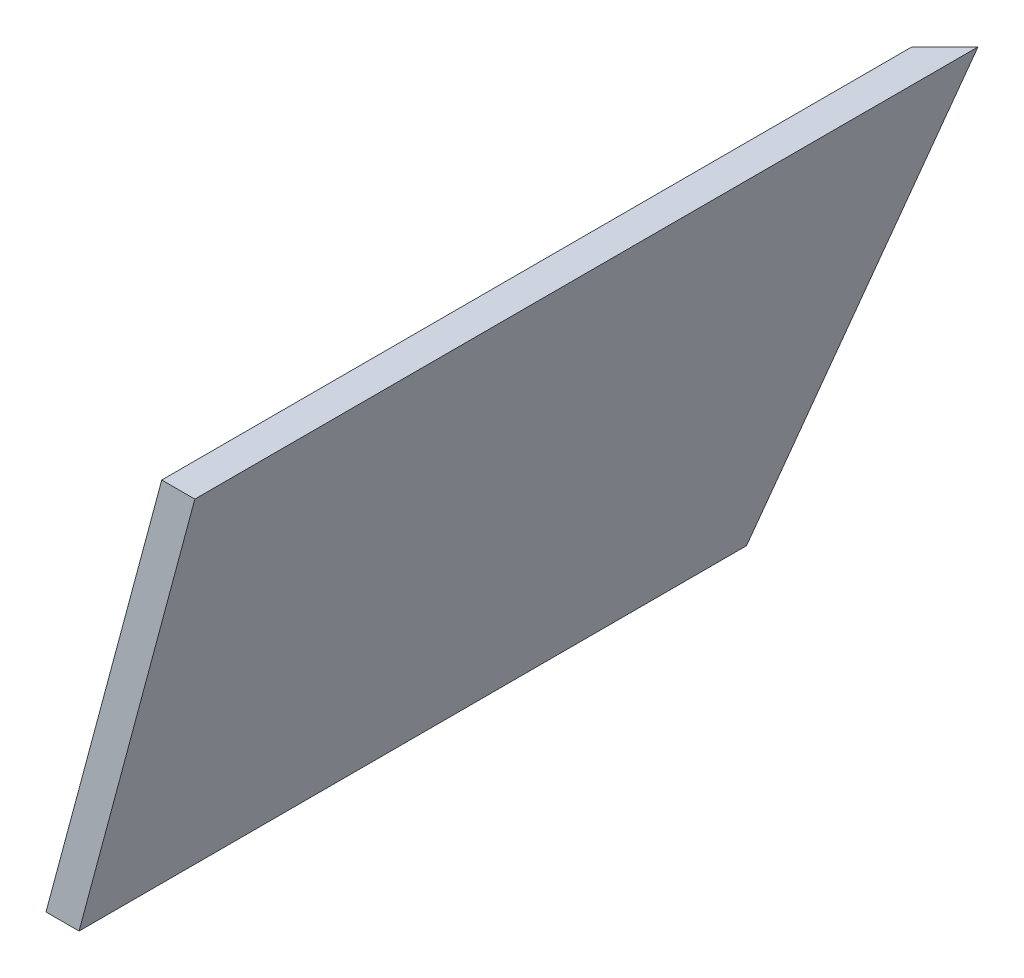
ISO-10303-21;
HEADER;
FILE_DESCRIPTION(('STEP AP214'),'2;1');
FILE_NAME('part.step','',(''),(''),'','','');
FILE_SCHEMA(('AUTOMOTIVE_DESIGN { 1 0 10303 214 1 1 1 1 }'));
ENDSEC;
DATA;
#1=APPLICATION_CONTEXT('core data for automotive mechanical design processes');
#2=APPLICATION_PROTOCOL_DEFINITION('international standard','automotive_design',2000,#1);
#3=PRODUCT_CONTEXT('',#1,'mechanical');
#4=PRODUCT('Part','Part','',(#3));
#5=PRODUCT_RELATED_PRODUCT_CATEGORY('part','',(#4));
#6=PRODUCT_DEFINITION_FORMATION('','',#4);
#7=PRODUCT_DEFINITION_CONTEXT('part definition',#1,'design');
#8=PRODUCT_DEFINITION('design','',#6,#7);
#9=PRODUCT_DEFINITION_SHAPE('','',#8);
#10=(LENGTH_UNIT() NAMED_UNIT(*) SI_UNIT(.MILLI.,.METRE.));
#11=(NAMED_UNIT(*) PLANE_ANGLE_UNIT() SI_UNIT($,.RADIAN.));
#12=(NAMED_UNIT(*) SI_UNIT($,.STERADIAN.) SOLID_ANGLE_UNIT());
#13=UNCERTAINTY_MEASURE_WITH_UNIT(LENGTH_MEASURE(1.E-05),#10,'distance_accuracy_value','');
#14=(GEOMETRIC_REPRESENTATION_CONTEXT(3) GLOBAL_UNCERTAINTY_ASSIGNED_CONTEXT((#13)) GLOBAL_UNIT_ASSIGNED_CONTEXT((#10,
#11,#12)) REPRESENTATION_CONTEXT('',''));
#15=CARTESIAN_POINT('',(0.,0.,0.));
#16=DIRECTION('',(0.,0.,1.));
#17=DIRECTION('',(1.,0.,0.));
#18=AXIS2_PLACEMENT_3D('',#15,#16,#17);
#19=CARTESIAN_POINT('',(298.198418728019,171.741611914197,-501.031293715292));
#20=DIRECTION('',(-0.96592582628907,0.258819045102514,0.));
#21=DIRECTION('',(-0.258819045102514,-0.96592582628907,0.));
#22=AXIS2_PLACEMENT_3D('',#19,#20,#21);
#23=PLANE('',#22);
#24=DIRECTION('',(0.250562807085726,0.935113126531033,-0.250562807085726));
#25=VECTOR('',#24,1.);
#26=CARTESIAN_POINT('',(310.932615552035,219.26628145501,-310.932615552036));
#27=LINE('',#26,#25);
#28=CARTESIAN_POINT('',(252.180392508792,0.,-252.180392508792));
#29=VERTEX_POINT('',#28);
#30=CARTESIAN_POINT('',(298.198418728019,171.741611914197,-298.198418728019));
#31=VERTEX_POINT('',#30);
#32=EDGE_CURVE('E48',#29,#31,#27,.T.);
#33=ORIENTED_EDGE('',*,*,#32,.F.);
#34=DIRECTION('',(0.,0.,1.));
#35=VECTOR('',#34,1.);
#36=CARTESIAN_POINT('',(252.180392508792,0.,-501.031293715292));
#37=LINE('',#36,#35);
#38=CARTESIAN_POINT('',(252.180392508792,0.,0.));
#39=VERTEX_POINT('',#38);
#40=EDGE_CURVE('E76',#29,#39,#37,.T.);
#41=ORIENTED_EDGE('',*,*,#40,.T.);
#42=DIRECTION('',(-0.258819045102514,-0.96592582628907,0.));
#43=VECTOR('',#42,1.);
#44=CARTESIAN_POINT('',(298.198418728019,171.741611914197,0.));
#45=LINE('',#44,#43);
#46=CARTESIAN_POINT('',(298.198418728019,171.741611914197,0.));
#47=VERTEX_POINT('',#46);
#48=EDGE_CURVE('E80',#47,#39,#45,.T.);
#49=ORIENTED_EDGE('',*,*,#48,.F.);
#50=DIRECTION('',(0.,0.,1.));
#51=VECTOR('',#50,1.);
#52=CARTESIAN_POINT('',(298.198418728019,171.741611914197,-501.031293715292));
#53=LINE('',#52,#51);
#54=EDGE_CURVE('E108',#31,#47,#53,.T.);
#55=ORIENTED_EDGE('',*,*,#54,.F.);
#56=EDGE_LOOP('',(#33,#41,#49,#55));
#57=FACE_BOUND('',#56,.T.);
#58=ADVANCED_FACE('F39',(#57),#23,.T.);
#59=CARTESIAN_POINT('',(311.346426219227,171.741611914197,-501.031293715292));
#60=DIRECTION('',(0.,1.,0.));
#61=DIRECTION('',(0.,0.,1.));
#62=AXIS2_PLACEMENT_3D('',#59,#60,#61);
#63=PLANE('',#62);
#64=DIRECTION('',(0.707106781186548,0.,-0.707106781186548));
#65=VECTOR('',#64,1.);
#66=CARTESIAN_POINT('',(406.18885996726,171.741611914197,-406.18885996726));
#67=LINE('',#66,#65);
#68=CARTESIAN_POINT('',(311.346426219227,171.741611914197,-311.346426219227));
#69=VERTEX_POINT('',#68);
#70=EDGE_CURVE('E54',#31,#69,#67,.T.);
#71=ORIENTED_EDGE('',*,*,#70,.F.);
#72=ORIENTED_EDGE('',*,*,#54,.T.);
#73=DIRECTION('',(-1.,0.,0.));
#74=VECTOR('',#73,1.);
#75=CARTESIAN_POINT('',(311.346426219227,171.741611914197,0.));
#76=LINE('',#75,#74);
#77=CARTESIAN_POINT('',(311.346426219227,171.741611914197,0.));
#78=VERTEX_POINT('',#77);
#79=EDGE_CURVE('E86',#78,#47,#76,.T.);
#80=ORIENTED_EDGE('',*,*,#79,.F.);
#81=DIRECTION('',(0.,0.,1.));
#82=VECTOR('',#81,1.);
#83=CARTESIAN_POINT('',(311.346426219227,171.741611914197,-501.031293715292));
#84=LINE('',#83,#82);
#85=EDGE_CURVE('E112',#69,#78,#84,.T.);
#86=ORIENTED_EDGE('',*,*,#85,.F.);
#87=EDGE_LOOP('',(#71,#72,#80,#86));
#88=FACE_BOUND('',#87,.T.);
#89=ADVANCED_FACE('F123',(#88),#63,.T.);
#90=CARTESIAN_POINT('',(265.3284,0.,-501.031293715292));
#91=DIRECTION('',(0.96592582628907,-0.258819045102514,0.));
#92=DIRECTION('',(0.258819045102514,0.96592582628907,0.));
#93=AXIS2_PLACEMENT_3D('',#90,#91,#92);
#94=PLANE('',#93);
#95=DIRECTION('',(-0.250562807085726,-0.935113126531033,0.250562807085726));
#96=VECTOR('',#95,1.);
#97=CARTESIAN_POINT('',(280.12623314588,55.2262651423518,-280.12623314588));
#98=LINE('',#97,#96);
#99=CARTESIAN_POINT('',(265.3284,0.,-265.3284));
#100=VERTEX_POINT('',#99);
#101=EDGE_CURVE('E111',#69,#100,#98,.T.);
#102=ORIENTED_EDGE('',*,*,#101,.F.);
#103=ORIENTED_EDGE('',*,*,#85,.T.);
#104=DIRECTION('',(0.258819045102514,0.96592582628907,0.));
#105=VECTOR('',#104,1.);
#106=CARTESIAN_POINT('',(265.3284,0.,0.));
#107=LINE('',#106,#105);
#108=CARTESIAN_POINT('',(265.3284,0.,0.));
#109=VERTEX_POINT('',#108);
#110=EDGE_CURVE('E95',#109,#78,#107,.T.);
#111=ORIENTED_EDGE('',*,*,#110,.F.);
#112=DIRECTION('',(0.,0.,1.));
#113=VECTOR('',#112,1.);
#114=CARTESIAN_POINT('',(265.3284,0.,-501.031293715292));
#115=LINE('',#114,#113);
#116=EDGE_CURVE('E85',#100,#109,#115,.T.);
#117=ORIENTED_EDGE('',*,*,#116,.F.);
#118=EDGE_LOOP('',(#102,#103,#111,#117));
#119=FACE_BOUND('',#118,.T.);
#120=ADVANCED_FACE('F125',(#119),#94,.T.);
#121=CARTESIAN_POINT('',(252.180392508792,0.,-501.031293715292));
#122=DIRECTION('',(0.,-1.,0.));
#123=DIRECTION('',(0.,0.,-1.));
#124=AXIS2_PLACEMENT_3D('',#121,#122,#123);
#125=PLANE('',#124);
#126=DIRECTION('',(-0.707106781186548,0.,0.707106781186548));
#127=VECTOR('',#126,1.);
#128=CARTESIAN_POINT('',(376.605843112042,0.,-376.605843112042));
#129=LINE('',#128,#127);
#130=EDGE_CURVE('E11',#100,#29,#129,.T.);
#131=ORIENTED_EDGE('',*,*,#130,.F.);
#132=ORIENTED_EDGE('',*,*,#116,.T.);
#133=DIRECTION('',(1.,0.,0.));
#134=VECTOR('',#133,1.);
#135=CARTESIAN_POINT('',(252.180392508792,0.,0.));
#136=LINE('',#135,#134);
#137=EDGE_CURVE('E88',#39,#109,#136,.T.);
#138=ORIENTED_EDGE('',*,*,#137,.F.);
#139=ORIENTED_EDGE('',*,*,#40,.F.);
#140=EDGE_LOOP('',(#131,#132,#138,#139));
#141=FACE_BOUND('',#140,.T.);
#142=ADVANCED_FACE('F89',(#141),#125,.T.);
#143=CARTESIAN_POINT('',(0.,0.,0.));
#144=DIRECTION('',(0.,0.,1.));
#145=DIRECTION('',(1.,0.,0.));
#146=AXIS2_PLACEMENT_3D('',#143,#144,#145);
#147=PLANE('',#146);
#148=ORIENTED_EDGE('',*,*,#48,.T.);
#149=ORIENTED_EDGE('',*,*,#137,.T.);
#150=ORIENTED_EDGE('',*,*,#110,.T.);
#151=ORIENTED_EDGE('',*,*,#79,.T.);
#152=EDGE_LOOP('',(#148,#149,#150,#151));
#153=FACE_BOUND('',#152,.T.);
#154=ADVANCED_FACE('F97',(#153),#147,.T.);
#155=CARTESIAN_POINT('',(0.,0.,0.));
#156=DIRECTION('',(0.707106781186548,0.,0.707106781186548));
#157=DIRECTION('',(0.707106781186548,0.,-0.707106781186548));
#158=AXIS2_PLACEMENT_3D('',#155,#156,#157);
#159=PLANE('',#158);
#160=ORIENTED_EDGE('',*,*,#32,.T.);
#161=ORIENTED_EDGE('',*,*,#70,.T.);
#162=ORIENTED_EDGE('',*,*,#101,.T.);
#163=ORIENTED_EDGE('',*,*,#130,.T.);
#164=EDGE_LOOP('',(#160,#161,#162,#163));
#165=FACE_BOUND('',#164,.T.);
#166=ADVANCED_FACE('F120',(#165),#159,.F.);
#167=CLOSED_SHELL('',(#58,#89,#120,#142,#154,#166));
#168=MANIFOLD_SOLID_BREP('B2',#167);
#169=ADVANCED_BREP_SHAPE_REPRESENTATION('',(#18,#168),#14);
#170=SHAPE_DEFINITION_REPRESENTATION(#9,#169);
ENDSEC;
END-ISO-10303-21;
